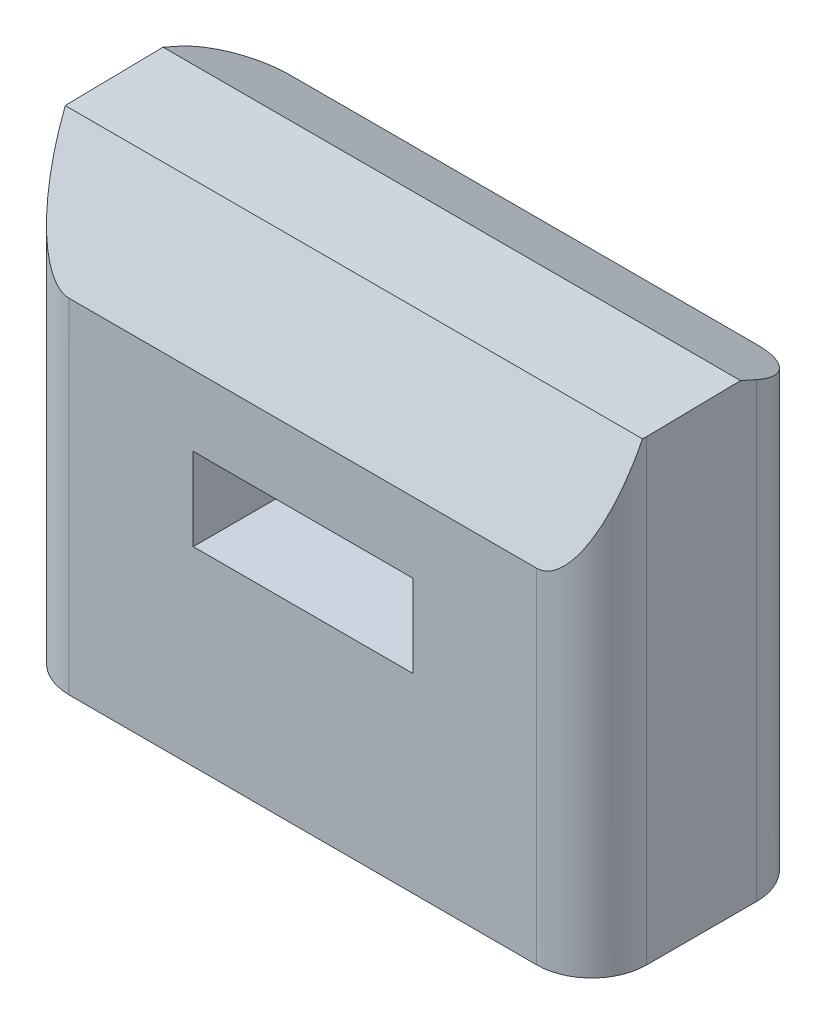
ISO-10303-21;
HEADER;
FILE_DESCRIPTION(('STEP AP214'),'2;1');
FILE_NAME('part.step','',(''),(''),'','','');
FILE_SCHEMA(('AUTOMOTIVE_DESIGN { 1 0 10303 214 1 1 1 1 }'));
ENDSEC;
DATA;
#1=APPLICATION_CONTEXT('core data for automotive mechanical design processes');
#2=APPLICATION_PROTOCOL_DEFINITION('international standard','automotive_design',2000,#1);
#3=PRODUCT_CONTEXT('',#1,'mechanical');
#4=PRODUCT('Part','Part','',(#3));
#5=PRODUCT_RELATED_PRODUCT_CATEGORY('part','',(#4));
#6=PRODUCT_DEFINITION_FORMATION('','',#4);
#7=PRODUCT_DEFINITION_CONTEXT('part definition',#1,'design');
#8=PRODUCT_DEFINITION('design','',#6,#7);
#9=PRODUCT_DEFINITION_SHAPE('','',#8);
#10=(LENGTH_UNIT() NAMED_UNIT(*) SI_UNIT(.MILLI.,.METRE.));
#11=(NAMED_UNIT(*) PLANE_ANGLE_UNIT() SI_UNIT($,.RADIAN.));
#12=(NAMED_UNIT(*) SI_UNIT($,.STERADIAN.) SOLID_ANGLE_UNIT());
#13=UNCERTAINTY_MEASURE_WITH_UNIT(LENGTH_MEASURE(1.E-05),#10,'distance_accuracy_value','');
#14=(GEOMETRIC_REPRESENTATION_CONTEXT(3) GLOBAL_UNCERTAINTY_ASSIGNED_CONTEXT((#13)) GLOBAL_UNIT_ASSIGNED_CONTEXT((#10,
#11,#12)) REPRESENTATION_CONTEXT('',''));
#15=CARTESIAN_POINT('',(0.,0.,0.));
#16=DIRECTION('',(0.,0.,1.));
#17=DIRECTION('',(1.,0.,0.));
#18=AXIS2_PLACEMENT_3D('',#15,#16,#17);
#19=CARTESIAN_POINT('',(-45.4997652654269,-58.8573743922204,40.));
#20=DIRECTION('',(0.,1.,0.));
#21=DIRECTION('',(0.,0.,1.));
#22=AXIS2_PLACEMENT_3D('',#19,#20,#21);
#23=PLANE('',#22);
#24=DIRECTION('',(0.,0.,-1.));
#25=VECTOR('',#24,1.);
#26=CARTESIAN_POINT('',(-45.4997652654269,-58.8573743922204,40.));
#27=LINE('',#26,#25);
#28=CARTESIAN_POINT('',(-45.4997652654269,-58.8573743922204,29.999999934));
#29=VERTEX_POINT('',#28);
#30=CARTESIAN_POINT('',(-45.4997652654269,-58.8573743922204,10.000000066));
#31=VERTEX_POINT('',#30);
#32=EDGE_CURVE('E286',#29,#31,#27,.T.);
#33=ORIENTED_EDGE('',*,*,#32,.T.);
#34=CARTESIAN_POINT('',(-35.4997651994269,-58.8573743922204,10.000000066));
#35=DIRECTION('',(0.,1.,0.));
#36=DIRECTION('',(0.,0.,1.));
#37=AXIS2_PLACEMENT_3D('',#34,#35,#36);
#38=CIRCLE('',#37,10.000000066);
#39=CARTESIAN_POINT('',(-35.4997651994269,-58.8573743922204,0.));
#40=VERTEX_POINT('',#39);
#41=EDGE_CURVE('E317',#31,#40,#38,.F.);
#42=ORIENTED_EDGE('',*,*,#41,.T.);
#43=DIRECTION('',(1.,0.,0.));
#44=VECTOR('',#43,1.);
#45=CARTESIAN_POINT('',(-45.4997652654269,-58.8573743922204,0.));
#46=LINE('',#45,#44);
#47=CARTESIAN_POINT('',(49.5002346685731,-58.8573743922204,0.));
#48=VERTEX_POINT('',#47);
#49=EDGE_CURVE('E280',#40,#48,#46,.T.);
#50=ORIENTED_EDGE('',*,*,#49,.T.);
#51=CARTESIAN_POINT('',(49.5002346685731,-58.8573743922204,10.000000066));
#52=DIRECTION('',(0.,1.,0.));
#53=DIRECTION('',(0.,0.,1.));
#54=AXIS2_PLACEMENT_3D('',#51,#52,#53);
#55=CIRCLE('',#54,10.000000066);
#56=CARTESIAN_POINT('',(59.5002347345731,-58.8573743922204,10.000000066));
#57=VERTEX_POINT('',#56);
#58=EDGE_CURVE('E310',#48,#57,#55,.F.);
#59=ORIENTED_EDGE('',*,*,#58,.T.);
#60=DIRECTION('',(0.,0.,-1.));
#61=VECTOR('',#60,1.);
#62=CARTESIAN_POINT('',(59.5002347345731,-58.8573743922204,40.));
#63=LINE('',#62,#61);
#64=CARTESIAN_POINT('',(59.5002347345731,-58.8573743922204,29.999999934));
#65=VERTEX_POINT('',#64);
#66=EDGE_CURVE('E291',#65,#57,#63,.T.);
#67=ORIENTED_EDGE('',*,*,#66,.F.);
#68=CARTESIAN_POINT('',(49.5002346685731,-58.8573743922204,29.999999934));
#69=DIRECTION('',(0.,1.,0.));
#70=DIRECTION('',(0.,0.,1.));
#71=AXIS2_PLACEMENT_3D('',#68,#69,#70);
#72=CIRCLE('',#71,10.000000066);
#73=CARTESIAN_POINT('',(49.5002346685731,-58.8573743922204,40.));
#74=VERTEX_POINT('',#73);
#75=EDGE_CURVE('E296',#65,#74,#72,.F.);
#76=ORIENTED_EDGE('',*,*,#75,.T.);
#77=DIRECTION('',(1.,0.,0.));
#78=VECTOR('',#77,1.);
#79=CARTESIAN_POINT('',(-45.4997652654269,-58.8573743922204,40.));
#80=LINE('',#79,#78);
#81=CARTESIAN_POINT('',(-35.4997651994269,-58.8573743922204,40.));
#82=VERTEX_POINT('',#81);
#83=EDGE_CURVE('E284',#82,#74,#80,.T.);
#84=ORIENTED_EDGE('',*,*,#83,.F.);
#85=CARTESIAN_POINT('',(-35.4997651994269,-58.8573743922204,29.999999934));
#86=DIRECTION('',(0.,1.,0.));
#87=DIRECTION('',(0.,0.,1.));
#88=AXIS2_PLACEMENT_3D('',#85,#86,#87);
#89=CIRCLE('',#88,10.000000066);
#90=EDGE_CURVE('E304',#82,#29,#89,.F.);
#91=ORIENTED_EDGE('',*,*,#90,.T.);
#92=EDGE_LOOP('',(#33,#42,#50,#59,#67,#76,#84,#91));
#93=FACE_BOUND('',#92,.T.);
#94=ADVANCED_FACE('F41',(#93),#23,.F.);
#95=CARTESIAN_POINT('',(59.5002347345731,31.1426256077796,40.));
#96=DIRECTION('',(1.,0.,0.));
#97=DIRECTION('',(0.,1.,0.));
#98=AXIS2_PLACEMENT_3D('',#95,#96,#97);
#99=PLANE('',#98);
#100=DIRECTION('',(0.,-0.407798932237558,-0.913071755595313));
#101=VECTOR('',#100,1.);
#102=CARTESIAN_POINT('',(59.5002347345731,35.7821027076506,37.9279023845892));
#103=LINE('',#102,#101);
#104=CARTESIAN_POINT('',(59.5002347345731,23.3088565740759,10.000000066));
#105=VERTEX_POINT('',#104);
#106=CARTESIAN_POINT('',(59.5002347345731,24.6211643907402,12.9382892750191));
#107=VERTEX_POINT('',#106);
#108=EDGE_CURVE('E327',#105,#107,#103,.F.);
#109=ORIENTED_EDGE('',*,*,#108,.T.);
#110=DIRECTION('',(0.,0.0162894503620875,-0.999867318101208));
#111=VECTOR('',#110,1.);
#112=CARTESIAN_POINT('',(59.5002347345731,24.1821329309667,39.8866023542304));
#113=LINE('',#112,#111);
#114=CARTESIAN_POINT('',(59.5002347345731,24.3432016212404,29.999999934));
#115=VERTEX_POINT('',#114);
#116=EDGE_CURVE('E342',#107,#115,#113,.F.);
#117=ORIENTED_EDGE('',*,*,#116,.T.);
#118=DIRECTION('',(0.,-1.,0.));
#119=VECTOR('',#118,1.);
#120=CARTESIAN_POINT('',(59.5002347345731,-58.8573743922204,29.999999934));
#121=LINE('',#120,#119);
#122=EDGE_CURVE('E294',#115,#65,#121,.T.);
#123=ORIENTED_EDGE('',*,*,#122,.T.);
#124=ORIENTED_EDGE('',*,*,#66,.T.);
#125=DIRECTION('',(0.,-1.,0.));
#126=VECTOR('',#125,1.);
#127=CARTESIAN_POINT('',(59.5002347345731,31.1426256077796,10.000000066));
#128=LINE('',#127,#126);
#129=EDGE_CURVE('E312',#57,#105,#128,.F.);
#130=ORIENTED_EDGE('',*,*,#129,.T.);
#131=EDGE_LOOP('',(#109,#117,#123,#124,#130));
#132=FACE_BOUND('',#131,.T.);
#133=ADVANCED_FACE('F803',(#132),#99,.T.);
#134=CARTESIAN_POINT('',(-45.4997652654269,31.1426256077796,40.));
#135=DIRECTION('',(1.,0.,0.));
#136=DIRECTION('',(0.,1.,0.));
#137=AXIS2_PLACEMENT_3D('',#134,#135,#136);
#138=PLANE('',#137);
#139=DIRECTION('',(0.,-1.,0.));
#140=VECTOR('',#139,1.);
#141=CARTESIAN_POINT('',(-45.4997652654269,31.1426256077796,29.999999934));
#142=LINE('',#141,#140);
#143=CARTESIAN_POINT('',(-45.4997652654269,24.3432016212404,29.999999934));
#144=VERTEX_POINT('',#143);
#145=EDGE_CURVE('E306',#29,#144,#142,.F.);
#146=ORIENTED_EDGE('',*,*,#145,.T.);
#147=DIRECTION('',(0.,-0.0162894503620875,0.999867318101208));
#148=VECTOR('',#147,1.);
#149=CARTESIAN_POINT('',(-45.4997652654269,31.1426256077796,-387.357349450669));
#150=LINE('',#149,#148);
#151=CARTESIAN_POINT('',(-45.4997652654269,24.6211643907402,12.9382892750192));
#152=VERTEX_POINT('',#151);
#153=EDGE_CURVE('E350',#144,#152,#150,.F.);
#154=ORIENTED_EDGE('',*,*,#153,.T.);
#155=DIRECTION('',(0.,0.407798932237558,0.913071755595313));
#156=VECTOR('',#155,1.);
#157=CARTESIAN_POINT('',(-45.4997652654269,18.8426256077796,0.));
#158=LINE('',#157,#156);
#159=CARTESIAN_POINT('',(-45.4997652654269,23.3088565740759,10.000000066));
#160=VERTEX_POINT('',#159);
#161=EDGE_CURVE('E330',#152,#160,#158,.F.);
#162=ORIENTED_EDGE('',*,*,#161,.T.);
#163=DIRECTION('',(0.,-1.,0.));
#164=VECTOR('',#163,1.);
#165=CARTESIAN_POINT('',(-45.4997652654269,-58.8573743922204,10.000000066));
#166=LINE('',#165,#164);
#167=EDGE_CURVE('E315',#160,#31,#166,.T.);
#168=ORIENTED_EDGE('',*,*,#167,.T.);
#169=ORIENTED_EDGE('',*,*,#32,.F.);
#170=EDGE_LOOP('',(#146,#154,#162,#168,#169));
#171=FACE_BOUND('',#170,.T.);
#172=ADVANCED_FACE('F795',(#171),#138,.F.);
#173=CARTESIAN_POINT('',(0.,0.,40.));
#174=DIRECTION('',(0.,0.,-1.));
#175=DIRECTION('',(-1.,0.,0.));
#176=AXIS2_PLACEMENT_3D('',#173,#174,#175);
#177=PLANE('',#176);
#178=DIRECTION('',(-1.,0.,0.));
#179=VECTOR('',#178,1.);
#180=CARTESIAN_POINT('',(-12.9547651994269,-9.2173743922204,40.));
#181=LINE('',#180,#179);
#182=CARTESIAN_POINT('',(27.0452348005731,-9.2173743922204,40.));
#183=VERTEX_POINT('',#182);
#184=CARTESIAN_POINT('',(-12.9547651994269,-9.2173743922204,40.));
#185=VERTEX_POINT('',#184);
#186=EDGE_CURVE('E274',#183,#185,#181,.T.);
#187=ORIENTED_EDGE('',*,*,#186,.F.);
#188=DIRECTION('',(0.,1.,0.));
#189=VECTOR('',#188,1.);
#190=CARTESIAN_POINT('',(27.0452348005731,-9.2173743922204,40.));
#191=LINE('',#190,#189);
#192=CARTESIAN_POINT('',(27.0452348005731,-24.2173743922204,40.));
#193=VERTEX_POINT('',#192);
#194=EDGE_CURVE('E158',#193,#183,#191,.T.);
#195=ORIENTED_EDGE('',*,*,#194,.F.);
#196=DIRECTION('',(1.,0.,0.));
#197=VECTOR('',#196,1.);
#198=CARTESIAN_POINT('',(-12.9547651994269,-24.2173743922204,40.));
#199=LINE('',#198,#197);
#200=CARTESIAN_POINT('',(-12.9547651994269,-24.2173743922204,40.));
#201=VERTEX_POINT('',#200);
#202=EDGE_CURVE('E265',#201,#193,#199,.T.);
#203=ORIENTED_EDGE('',*,*,#202,.F.);
#204=DIRECTION('',(0.,-1.,0.));
#205=VECTOR('',#204,1.);
#206=CARTESIAN_POINT('',(-12.9547651994269,-9.2173743922204,40.));
#207=LINE('',#206,#205);
#208=EDGE_CURVE('E268',#185,#201,#207,.T.);
#209=ORIENTED_EDGE('',*,*,#208,.F.);
#210=EDGE_LOOP('',(#187,#195,#203,#209));
#211=FACE_BOUND('',#210,.T.);
#212=DIRECTION('',(0.,-1.,0.));
#213=VECTOR('',#212,1.);
#214=CARTESIAN_POINT('',(49.5002346685731,31.1426256077796,40.));
#215=LINE('',#214,#213);
#216=CARTESIAN_POINT('',(49.5002346685731,3.6026256077796,40.));
#217=VERTEX_POINT('',#216);
#218=EDGE_CURVE('E299',#74,#217,#215,.F.);
#219=ORIENTED_EDGE('',*,*,#218,.T.);
#220=DIRECTION('',(-1.,0.,0.));
#221=VECTOR('',#220,1.);
#222=CARTESIAN_POINT('',(-35.4997651994269,3.6026256077796,40.));
#223=LINE('',#222,#221);
#224=CARTESIAN_POINT('',(-35.4997651994269,3.6026256077796,40.));
#225=VERTEX_POINT('',#224);
#226=EDGE_CURVE('E336',#217,#225,#223,.T.);
#227=ORIENTED_EDGE('',*,*,#226,.T.);
#228=DIRECTION('',(0.,-1.,0.));
#229=VECTOR('',#228,1.);
#230=CARTESIAN_POINT('',(-35.4997651994269,0.,40.));
#231=LINE('',#230,#229);
#232=EDGE_CURVE('E302',#225,#82,#231,.T.);
#233=ORIENTED_EDGE('',*,*,#232,.T.);
#234=ORIENTED_EDGE('',*,*,#83,.T.);
#235=EDGE_LOOP('',(#219,#227,#233,#234));
#236=FACE_BOUND('',#235,.T.);
#237=ADVANCED_FACE('F786',(#211,#236),#177,.F.);
#238=CARTESIAN_POINT('',(0.,0.,0.));
#239=DIRECTION('',(0.,0.,-1.));
#240=DIRECTION('',(-1.,0.,0.));
#241=AXIS2_PLACEMENT_3D('',#238,#239,#240);
#242=PLANE('',#241);
#243=DIRECTION('',(0.,-1.,0.));
#244=VECTOR('',#243,1.);
#245=CARTESIAN_POINT('',(-35.4997651994269,31.1426256077796,0.));
#246=LINE('',#245,#244);
#247=CARTESIAN_POINT('',(-35.4997651994269,18.8426256077796,0.));
#248=VERTEX_POINT('',#247);
#249=EDGE_CURVE('E319',#40,#248,#246,.F.);
#250=ORIENTED_EDGE('',*,*,#249,.T.);
#251=DIRECTION('',(1.,0.,0.));
#252=VECTOR('',#251,1.);
#253=CARTESIAN_POINT('',(0.,18.8426256077796,0.));
#254=LINE('',#253,#252);
#255=CARTESIAN_POINT('',(49.5002346685731,18.8426256077796,0.));
#256=VERTEX_POINT('',#255);
#257=EDGE_CURVE('E322',#248,#256,#254,.T.);
#258=ORIENTED_EDGE('',*,*,#257,.T.);
#259=DIRECTION('',(0.,-1.,0.));
#260=VECTOR('',#259,1.);
#261=CARTESIAN_POINT('',(49.5002346685731,0.,0.));
#262=LINE('',#261,#260);
#263=EDGE_CURVE('E308',#256,#48,#262,.T.);
#264=ORIENTED_EDGE('',*,*,#263,.T.);
#265=ORIENTED_EDGE('',*,*,#49,.F.);
#266=EDGE_LOOP('',(#250,#258,#264,#265));
#267=FACE_BOUND('',#266,.T.);
#268=ADVANCED_FACE('F777',(#267),#242,.T.);
#269=CARTESIAN_POINT('',(49.5002346685731,31.1426256077796,29.999999934));
#270=DIRECTION('',(0.,1.,0.));
#271=DIRECTION('',(-1.,0.,0.));
#272=AXIS2_PLACEMENT_3D('',#269,#270,#271);
#273=CYLINDRICAL_SURFACE('',#272,10.000000066);
#274=ORIENTED_EDGE('',*,*,#122,.F.);
#275=CARTESIAN_POINT('',(49.5002346685731,24.3432016212404,29.999999934));
#276=DIRECTION('',(0.,-0.999867318101208,-0.0162894503620875));
#277=DIRECTION('',(0.,0.0162894503620875,-0.999867318101208));
#278=AXIS2_PLACEMENT_3D('',#275,#276,#277);
#279=ELLIPSE('',#278,10.0013270610649,10.000000066);
#280=CARTESIAN_POINT('',(59.4726551379693,24.3311103110357,30.7421800344935));
#281=VERTEX_POINT('',#280);
#282=EDGE_CURVE('E344',#115,#281,#279,.T.);
#283=ORIENTED_EDGE('',*,*,#282,.T.);
#284=CARTESIAN_POINT('',(49.5002346685731,25.9928696579942,29.999999934));
#285=DIRECTION('',(0.,0.407798932237558,0.913071755595313));
#286=DIRECTION('',(0.,0.913071755595313,-0.407798932237558));
#287=AXIS2_PLACEMENT_3D('',#284,#285,#286);
#288=ELLIPSE('',#287,24.5218887924273,10.000000066);
#289=EDGE_CURVE('E334',#281,#217,#288,.F.);
#290=ORIENTED_EDGE('',*,*,#289,.T.);
#291=ORIENTED_EDGE('',*,*,#218,.F.);
#292=ORIENTED_EDGE('',*,*,#75,.F.);
#293=EDGE_LOOP('',(#274,#283,#290,#291,#292));
#294=FACE_BOUND('',#293,.T.);
#295=ADVANCED_FACE('F769',(#294),#273,.T.);
#296=CARTESIAN_POINT('',(-35.4997651994269,0.,29.999999934));
#297=DIRECTION('',(0.,-1.,0.));
#298=DIRECTION('',(1.,0.,0.));
#299=AXIS2_PLACEMENT_3D('',#296,#297,#298);
#300=CYLINDRICAL_SURFACE('',#299,10.000000066);
#301=CARTESIAN_POINT('',(-35.4997651994269,25.9928696579942,29.999999934));
#302=DIRECTION('',(0.,0.407798932237558,0.913071755595313));
#303=DIRECTION('',(0.,-0.913071755595313,0.407798932237558));
#304=AXIS2_PLACEMENT_3D('',#301,#302,#303);
#305=ELLIPSE('',#304,24.5218887924273,10.000000066);
#306=CARTESIAN_POINT('',(-45.4721856688231,24.3311103110357,30.7421800344935));
#307=VERTEX_POINT('',#306);
#308=EDGE_CURVE('E338',#225,#307,#305,.F.);
#309=ORIENTED_EDGE('',*,*,#308,.T.);
#310=CARTESIAN_POINT('',(-35.4997651994269,24.3432016212404,29.999999934));
#311=DIRECTION('',(0.,-0.999867318101208,-0.0162894503620875));
#312=DIRECTION('',(0.,-0.0162894503620875,0.999867318101208));
#313=AXIS2_PLACEMENT_3D('',#310,#311,#312);
#314=ELLIPSE('',#313,10.0013270610649,10.000000066);
#315=EDGE_CURVE('E166',#307,#144,#314,.T.);
#316=ORIENTED_EDGE('',*,*,#315,.T.);
#317=ORIENTED_EDGE('',*,*,#145,.F.);
#318=ORIENTED_EDGE('',*,*,#90,.F.);
#319=ORIENTED_EDGE('',*,*,#232,.F.);
#320=EDGE_LOOP('',(#309,#316,#317,#318,#319));
#321=FACE_BOUND('',#320,.T.);
#322=ADVANCED_FACE('F760',(#321),#300,.T.);
#323=CARTESIAN_POINT('',(49.5002346685731,0.,10.000000066));
#324=DIRECTION('',(0.,-1.,0.));
#325=DIRECTION('',(1.,0.,0.));
#326=AXIS2_PLACEMENT_3D('',#323,#324,#325);
#327=CYLINDRICAL_SURFACE('',#326,10.000000066);
#328=ORIENTED_EDGE('',*,*,#263,.F.);
#329=CARTESIAN_POINT('',(49.5002346685731,23.3088565740759,10.000000066));
#330=DIRECTION('',(0.,-0.913071755595313,0.407798932237558));
#331=DIRECTION('',(0.,-0.407798932237558,-0.913071755595313));
#332=AXIS2_PLACEMENT_3D('',#329,#330,#331);
#333=ELLIPSE('',#332,10.9520418353978,10.000000066);
#334=EDGE_CURVE('E325',#256,#105,#333,.T.);
#335=ORIENTED_EDGE('',*,*,#334,.T.);
#336=ORIENTED_EDGE('',*,*,#129,.F.);
#337=ORIENTED_EDGE('',*,*,#58,.F.);
#338=EDGE_LOOP('',(#328,#335,#336,#337));
#339=FACE_BOUND('',#338,.T.);
#340=ADVANCED_FACE('F750',(#339),#327,.T.);
#341=CARTESIAN_POINT('',(-35.4997651994269,31.1426256077796,10.000000066));
#342=DIRECTION('',(0.,1.,0.));
#343=DIRECTION('',(-1.,0.,0.));
#344=AXIS2_PLACEMENT_3D('',#341,#342,#343);
#345=CYLINDRICAL_SURFACE('',#344,10.000000066);
#346=ORIENTED_EDGE('',*,*,#167,.F.);
#347=CARTESIAN_POINT('',(-35.4997651994269,23.3088565740759,10.000000066));
#348=DIRECTION('',(0.,-0.913071755595313,0.407798932237558));
#349=DIRECTION('',(0.,0.407798932237558,0.913071755595313));
#350=AXIS2_PLACEMENT_3D('',#347,#348,#349);
#351=ELLIPSE('',#350,10.9520418353978,10.000000066);
#352=EDGE_CURVE('E332',#160,#248,#351,.T.);
#353=ORIENTED_EDGE('',*,*,#352,.T.);
#354=ORIENTED_EDGE('',*,*,#249,.F.);
#355=ORIENTED_EDGE('',*,*,#41,.F.);
#356=EDGE_LOOP('',(#346,#353,#354,#355));
#357=FACE_BOUND('',#356,.T.);
#358=ADVANCED_FACE('F740',(#357),#345,.T.);
#359=CARTESIAN_POINT('',(0.,18.8426256077796,0.));
#360=DIRECTION('',(0.,-0.913071755595313,0.407798932237558));
#361=DIRECTION('',(1.,0.,0.));
#362=AXIS2_PLACEMENT_3D('',#359,#360,#361);
#363=PLANE('',#362);
#364=ORIENTED_EDGE('',*,*,#161,.F.);
#365=DIRECTION('',(1.,0.,0.));
#366=VECTOR('',#365,1.);
#367=CARTESIAN_POINT('',(0.,24.6211643907402,12.9382892750191));
#368=LINE('',#367,#366);
#369=EDGE_CURVE('E340',#152,#107,#368,.T.);
#370=ORIENTED_EDGE('',*,*,#369,.T.);
#371=ORIENTED_EDGE('',*,*,#108,.F.);
#372=ORIENTED_EDGE('',*,*,#334,.F.);
#373=ORIENTED_EDGE('',*,*,#257,.F.);
#374=ORIENTED_EDGE('',*,*,#352,.F.);
#375=EDGE_LOOP('',(#364,#370,#371,#372,#373,#374));
#376=FACE_BOUND('',#375,.T.);
#377=ADVANCED_FACE('F732',(#376),#363,.F.);
#378=CARTESIAN_POINT('',(-45.4997652654269,31.1426256077796,27.7));
#379=DIRECTION('',(0.,0.407798932237558,0.913071755595313));
#380=DIRECTION('',(-1.,0.,0.));
#381=AXIS2_PLACEMENT_3D('',#378,#379,#380);
#382=PLANE('',#381);
#383=ORIENTED_EDGE('',*,*,#289,.F.);
#384=DIRECTION('',(-1.,0.,0.));
#385=VECTOR('',#384,1.);
#386=CARTESIAN_POINT('',(-45.4997652654269,24.3311103110357,30.7421800344935));
#387=LINE('',#386,#385);
#388=EDGE_CURVE('E346',#281,#307,#387,.T.);
#389=ORIENTED_EDGE('',*,*,#388,.T.);
#390=ORIENTED_EDGE('',*,*,#308,.F.);
#391=ORIENTED_EDGE('',*,*,#226,.F.);
#392=EDGE_LOOP('',(#383,#389,#390,#391));
#393=FACE_BOUND('',#392,.T.);
#394=ADVANCED_FACE('F724',(#393),#382,.T.);
#395=CARTESIAN_POINT('',(-45.4997652654269,31.1426256077796,-387.357349450669));
#396=DIRECTION('',(0.,-0.999867318101208,-0.0162894503620875));
#397=DIRECTION('',(1.,0.,0.));
#398=AXIS2_PLACEMENT_3D('',#395,#396,#397);
#399=PLANE('',#398);
#400=ORIENTED_EDGE('',*,*,#315,.F.);
#401=ORIENTED_EDGE('',*,*,#388,.F.);
#402=ORIENTED_EDGE('',*,*,#282,.F.);
#403=ORIENTED_EDGE('',*,*,#116,.F.);
#404=ORIENTED_EDGE('',*,*,#369,.F.);
#405=ORIENTED_EDGE('',*,*,#153,.F.);
#406=EDGE_LOOP('',(#400,#401,#402,#403,#404,#405));
#407=FACE_BOUND('',#406,.T.);
#408=ADVANCED_FACE('F508',(#407),#399,.F.);
#409=CARTESIAN_POINT('',(27.0452348005731,-9.2173743922204,22.22));
#410=DIRECTION('',(1.,0.,0.));
#411=DIRECTION('',(0.,1.,0.));
#412=AXIS2_PLACEMENT_3D('',#409,#410,#411);
#413=PLANE('',#412);
#414=ORIENTED_EDGE('',*,*,#194,.T.);
#415=DIRECTION('',(0.,0.,1.));
#416=VECTOR('',#415,1.);
#417=CARTESIAN_POINT('',(27.0452348005731,-9.2173743922204,22.22));
#418=LINE('',#417,#416);
#419=CARTESIAN_POINT('',(27.0452348005731,-9.2173743922204,22.22));
#420=VERTEX_POINT('',#419);
#421=EDGE_CURVE('E243',#420,#183,#418,.T.);
#422=ORIENTED_EDGE('',*,*,#421,.F.);
#423=DIRECTION('',(0.,1.,0.));
#424=VECTOR('',#423,1.);
#425=CARTESIAN_POINT('',(27.0452348005731,-9.2173743922204,22.22));
#426=LINE('',#425,#424);
#427=CARTESIAN_POINT('',(27.0452348005731,-24.2173743922204,22.22));
#428=VERTEX_POINT('',#427);
#429=EDGE_CURVE('E247',#428,#420,#426,.T.);
#430=ORIENTED_EDGE('',*,*,#429,.F.);
#431=DIRECTION('',(0.,0.,1.));
#432=VECTOR('',#431,1.);
#433=CARTESIAN_POINT('',(27.0452348005731,-24.2173743922204,22.22));
#434=LINE('',#433,#432);
#435=EDGE_CURVE('E278',#428,#193,#434,.T.);
#436=ORIENTED_EDGE('',*,*,#435,.T.);
#437=EDGE_LOOP('',(#414,#422,#430,#436));
#438=FACE_BOUND('',#437,.T.);
#439=ADVANCED_FACE('F245',(#438),#413,.F.);
#440=CARTESIAN_POINT('',(-12.9547651994269,-24.2173743922204,22.22));
#441=DIRECTION('',(0.,-1.,0.));
#442=DIRECTION('',(0.,0.,-1.));
#443=AXIS2_PLACEMENT_3D('',#440,#441,#442);
#444=PLANE('',#443);
#445=ORIENTED_EDGE('',*,*,#202,.T.);
#446=ORIENTED_EDGE('',*,*,#435,.F.);
#447=DIRECTION('',(1.,0.,0.));
#448=VECTOR('',#447,1.);
#449=CARTESIAN_POINT('',(-12.9547651994269,-24.2173743922204,22.22));
#450=LINE('',#449,#448);
#451=CARTESIAN_POINT('',(-12.9547651994269,-24.2173743922204,22.22));
#452=VERTEX_POINT('',#451);
#453=EDGE_CURVE('E253',#452,#428,#450,.T.);
#454=ORIENTED_EDGE('',*,*,#453,.F.);
#455=DIRECTION('',(0.,0.,1.));
#456=VECTOR('',#455,1.);
#457=CARTESIAN_POINT('',(-12.9547651994269,-24.2173743922204,22.22));
#458=LINE('',#457,#456);
#459=EDGE_CURVE('E281',#452,#201,#458,.T.);
#460=ORIENTED_EDGE('',*,*,#459,.T.);
#461=EDGE_LOOP('',(#445,#446,#454,#460));
#462=FACE_BOUND('',#461,.T.);
#463=ADVANCED_FACE('F615',(#462),#444,.F.);
#464=CARTESIAN_POINT('',(-12.9547651994269,-9.2173743922204,22.22));
#465=DIRECTION('',(-1.,0.,0.));
#466=DIRECTION('',(0.,-1.,0.));
#467=AXIS2_PLACEMENT_3D('',#464,#465,#466);
#468=PLANE('',#467);
#469=ORIENTED_EDGE('',*,*,#208,.T.);
#470=ORIENTED_EDGE('',*,*,#459,.F.);
#471=DIRECTION('',(0.,-1.,0.));
#472=VECTOR('',#471,1.);
#473=CARTESIAN_POINT('',(-12.9547651994269,-9.2173743922204,22.22));
#474=LINE('',#473,#472);
#475=CARTESIAN_POINT('',(-12.9547651994269,-9.2173743922204,22.22));
#476=VERTEX_POINT('',#475);
#477=EDGE_CURVE('E261',#476,#452,#474,.T.);
#478=ORIENTED_EDGE('',*,*,#477,.F.);
#479=DIRECTION('',(0.,0.,1.));
#480=VECTOR('',#479,1.);
#481=CARTESIAN_POINT('',(-12.9547651994269,-9.2173743922204,22.22));
#482=LINE('',#481,#480);
#483=EDGE_CURVE('E252',#476,#185,#482,.T.);
#484=ORIENTED_EDGE('',*,*,#483,.T.);
#485=EDGE_LOOP('',(#469,#470,#478,#484));
#486=FACE_BOUND('',#485,.T.);
#487=ADVANCED_FACE('F610',(#486),#468,.F.);
#488=CARTESIAN_POINT('',(-12.9547651994269,-9.2173743922204,22.22));
#489=DIRECTION('',(0.,1.,0.));
#490=DIRECTION('',(0.,0.,1.));
#491=AXIS2_PLACEMENT_3D('',#488,#489,#490);
#492=PLANE('',#491);
#493=ORIENTED_EDGE('',*,*,#186,.T.);
#494=ORIENTED_EDGE('',*,*,#483,.F.);
#495=DIRECTION('',(-1.,0.,0.));
#496=VECTOR('',#495,1.);
#497=CARTESIAN_POINT('',(-12.9547651994269,-9.2173743922204,22.22));
#498=LINE('',#497,#496);
#499=EDGE_CURVE('E256',#420,#476,#498,.T.);
#500=ORIENTED_EDGE('',*,*,#499,.F.);
#501=ORIENTED_EDGE('',*,*,#421,.T.);
#502=EDGE_LOOP('',(#493,#494,#500,#501));
#503=FACE_BOUND('',#502,.T.);
#504=ADVANCED_FACE('F257',(#503),#492,.F.);
#505=CARTESIAN_POINT('',(0.,0.,22.22));
#506=DIRECTION('',(0.,0.,1.));
#507=DIRECTION('',(1.,0.,0.));
#508=AXIS2_PLACEMENT_3D('',#505,#506,#507);
#509=PLANE('',#508);
#510=ORIENTED_EDGE('',*,*,#429,.T.);
#511=ORIENTED_EDGE('',*,*,#499,.T.);
#512=ORIENTED_EDGE('',*,*,#477,.T.);
#513=ORIENTED_EDGE('',*,*,#453,.T.);
#514=EDGE_LOOP('',(#510,#511,#512,#513));
#515=FACE_BOUND('',#514,.T.);
#516=ADVANCED_FACE('F263',(#515),#509,.T.);
#517=CLOSED_SHELL('',(#94,#133,#172,#237,#268,#295,#322,#340,#358,#377,#394,#408,#439,#463,#487,
#504,#516));
#518=CARTESIAN_POINT('',(-45.4997652654269,-56.3173743922204,40.));
#519=DIRECTION('',(0.,1.,0.));
#520=DIRECTION('',(0.,0.,1.));
#521=AXIS2_PLACEMENT_3D('',#518,#519,#520);
#522=PLANE('',#521);
#523=DIRECTION('',(0.,0.,-1.));
#524=VECTOR('',#523,1.);
#525=CARTESIAN_POINT('',(-42.9597652654269,-56.3173743922204,40.));
#526=LINE('',#525,#524);
#527=CARTESIAN_POINT('',(-42.9597652654269,-56.3173743922204,29.999999934));
#528=VERTEX_POINT('',#527);
#529=CARTESIAN_POINT('',(-42.9597652654269,-56.3173743922204,10.000000066));
#530=VERTEX_POINT('',#529);
#531=EDGE_CURVE('E45',#528,#530,#526,.T.);
#532=ORIENTED_EDGE('',*,*,#531,.F.);
#533=CARTESIAN_POINT('',(-35.4997651994269,-56.3173743922204,29.999999934));
#534=DIRECTION('',(0.,1.,0.));
#535=DIRECTION('',(0.,0.,1.));
#536=AXIS2_PLACEMENT_3D('',#533,#534,#535);
#537=CIRCLE('',#536,7.460000066);
#538=CARTESIAN_POINT('',(-35.4997651994269,-56.3173743922204,37.46));
#539=VERTEX_POINT('',#538);
#540=EDGE_CURVE('E433',#539,#528,#537,.F.);
#541=ORIENTED_EDGE('',*,*,#540,.F.);
#542=DIRECTION('',(1.,0.,0.));
#543=VECTOR('',#542,1.);
#544=CARTESIAN_POINT('',(0.,-56.3173743922204,37.46));
#545=LINE('',#544,#543);
#546=CARTESIAN_POINT('',(49.5002346685731,-56.3173743922204,37.46));
#547=VERTEX_POINT('',#546);
#548=EDGE_CURVE('E401',#539,#547,#545,.T.);
#549=ORIENTED_EDGE('',*,*,#548,.T.);
#550=CARTESIAN_POINT('',(49.5002346685731,-56.3173743922204,29.999999934));
#551=DIRECTION('',(0.,1.,0.));
#552=DIRECTION('',(0.,0.,1.));
#553=AXIS2_PLACEMENT_3D('',#550,#551,#552);
#554=CIRCLE('',#553,7.460000066);
#555=CARTESIAN_POINT('',(56.9602347345731,-56.3173743922204,29.999999934));
#556=VERTEX_POINT('',#555);
#557=EDGE_CURVE('E435',#556,#547,#554,.F.);
#558=ORIENTED_EDGE('',*,*,#557,.F.);
#559=DIRECTION('',(0.,0.,-1.));
#560=VECTOR('',#559,1.);
#561=CARTESIAN_POINT('',(56.9602347345731,-56.3173743922204,40.));
#562=LINE('',#561,#560);
#563=CARTESIAN_POINT('',(56.9602347345731,-56.3173743922204,10.000000066));
#564=VERTEX_POINT('',#563);
#565=EDGE_CURVE('E424',#556,#564,#562,.T.);
#566=ORIENTED_EDGE('',*,*,#565,.T.);
#567=CARTESIAN_POINT('',(49.5002346685731,-56.3173743922204,10.000000066));
#568=DIRECTION('',(0.,1.,0.));
#569=DIRECTION('',(0.,0.,1.));
#570=AXIS2_PLACEMENT_3D('',#567,#568,#569);
#571=CIRCLE('',#570,7.460000066);
#572=CARTESIAN_POINT('',(49.5002346685731,-56.3173743922204,2.54));
#573=VERTEX_POINT('',#572);
#574=EDGE_CURVE('E144',#573,#564,#571,.F.);
#575=ORIENTED_EDGE('',*,*,#574,.F.);
#576=DIRECTION('',(1.,0.,0.));
#577=VECTOR('',#576,1.);
#578=CARTESIAN_POINT('',(0.,-56.3173743922204,2.54));
#579=LINE('',#578,#577);
#580=CARTESIAN_POINT('',(-35.4997651994269,-56.3173743922204,2.54));
#581=VERTEX_POINT('',#580);
#582=EDGE_CURVE('E439',#581,#573,#579,.T.);
#583=ORIENTED_EDGE('',*,*,#582,.F.);
#584=CARTESIAN_POINT('',(-35.4997651994269,-56.3173743922204,10.000000066));
#585=DIRECTION('',(0.,1.,0.));
#586=DIRECTION('',(0.,0.,1.));
#587=AXIS2_PLACEMENT_3D('',#584,#585,#586);
#588=CIRCLE('',#587,7.460000066);
#589=EDGE_CURVE('E150',#530,#581,#588,.F.);
#590=ORIENTED_EDGE('',*,*,#589,.F.);
#591=EDGE_LOOP('',(#532,#541,#549,#558,#566,#575,#583,#590));
#592=FACE_BOUND('',#591,.T.);
#593=ADVANCED_FACE('F451',(#592),#522,.T.);
#594=CARTESIAN_POINT('',(56.9602347345731,31.1426256077796,40.));
#595=DIRECTION('',(1.,0.,0.));
#596=DIRECTION('',(0.,1.,0.));
#597=AXIS2_PLACEMENT_3D('',#594,#595,#596);
#598=PLANE('',#597);
#599=DIRECTION('',(0.,-0.407798932237558,-0.913071755595313));
#600=VECTOR('',#599,1.);
#601=CARTESIAN_POINT('',(56.9602347345731,33.4629004484385,38.9637116724726));
#602=LINE('',#601,#600);
#603=CARTESIAN_POINT('',(56.9602347345731,20.5270379662449,10.000000066));
#604=VERTEX_POINT('',#603);
#605=CARTESIAN_POINT('',(56.9602347345731,22.0723287408884,13.4599438004458));
#606=VERTEX_POINT('',#605);
#607=EDGE_CURVE('E430',#604,#606,#602,.F.);
#608=ORIENTED_EDGE('',*,*,#607,.F.);
#609=DIRECTION('',(0.,1.,0.));
#610=VECTOR('',#609,1.);
#611=CARTESIAN_POINT('',(56.9602347345731,31.1426256077796,10.000000066));
#612=LINE('',#611,#610);
#613=EDGE_CURVE('E422',#564,#604,#612,.T.);
#614=ORIENTED_EDGE('',*,*,#613,.F.);
#615=ORIENTED_EDGE('',*,*,#565,.F.);
#616=DIRECTION('',(0.,1.,0.));
#617=VECTOR('',#616,1.);
#618=CARTESIAN_POINT('',(56.9602347345731,31.1426256077796,29.999999934));
#619=LINE('',#618,#617);
#620=CARTESIAN_POINT('',(56.9602347345731,19.7643099458262,29.999999934));
#621=VERTEX_POINT('',#620);
#622=EDGE_CURVE('E426',#621,#556,#619,.F.);
#623=ORIENTED_EDGE('',*,*,#622,.F.);
#624=DIRECTION('',(0.,0.913071755595313,-0.407798932237558));
#625=VECTOR('',#624,1.);
#626=CARTESIAN_POINT('',(56.9602347345731,30.1068163198962,25.3807977407879));
#627=LINE('',#626,#625);
#628=CARTESIAN_POINT('',(56.9602347345731,21.8178062350107,29.0828610684601));
#629=VERTEX_POINT('',#628);
#630=EDGE_CURVE('E380',#621,#629,#627,.T.);
#631=ORIENTED_EDGE('',*,*,#630,.T.);
#632=DIRECTION('',(0.,0.0162894503620875,-0.999867318101208));
#633=VECTOR('',#632,1.);
#634=CARTESIAN_POINT('',(56.9602347345731,21.6424699429896,39.8452271503107));
#635=LINE('',#634,#633);
#636=EDGE_CURVE('E428',#606,#629,#635,.F.);
#637=ORIENTED_EDGE('',*,*,#636,.F.);
#638=EDGE_LOOP('',(#608,#614,#615,#623,#631,#637));
#639=FACE_BOUND('',#638,.T.);
#640=ADVANCED_FACE('F483',(#639),#598,.F.);
#641=CARTESIAN_POINT('',(-42.9597652654269,31.1426256077796,40.));
#642=DIRECTION('',(1.,0.,0.));
#643=DIRECTION('',(0.,1.,0.));
#644=AXIS2_PLACEMENT_3D('',#641,#642,#643);
#645=PLANE('',#644);
#646=DIRECTION('',(0.,1.,0.));
#647=VECTOR('',#646,1.);
#648=CARTESIAN_POINT('',(-42.9597652654269,31.1426256077796,29.999999934));
#649=LINE('',#648,#647);
#650=CARTESIAN_POINT('',(-42.9597652654269,19.7643099458262,29.999999934));
#651=VERTEX_POINT('',#650);
#652=EDGE_CURVE('E419',#528,#651,#649,.T.);
#653=ORIENTED_EDGE('',*,*,#652,.F.);
#654=ORIENTED_EDGE('',*,*,#531,.T.);
#655=DIRECTION('',(0.,1.,0.));
#656=VECTOR('',#655,1.);
#657=CARTESIAN_POINT('',(-42.9597652654269,31.1426256077796,10.000000066));
#658=LINE('',#657,#656);
#659=CARTESIAN_POINT('',(-42.9597652654269,20.5270379662449,10.000000066));
#660=VERTEX_POINT('',#659);
#661=EDGE_CURVE('E410',#660,#530,#658,.F.);
#662=ORIENTED_EDGE('',*,*,#661,.F.);
#663=DIRECTION('',(0.,0.407798932237558,0.913071755595313));
#664=VECTOR('',#663,1.);
#665=CARTESIAN_POINT('',(-42.9597652654269,16.5234233485675,1.03580928788339));
#666=LINE('',#665,#664);
#667=CARTESIAN_POINT('',(-42.9597652654269,22.0723287408884,13.4599438004458));
#668=VERTEX_POINT('',#667);
#669=EDGE_CURVE('E412',#668,#660,#666,.F.);
#670=ORIENTED_EDGE('',*,*,#669,.F.);
#671=DIRECTION('',(0.,-0.0162894503620875,0.999867318101208));
#672=VECTOR('',#671,1.);
#673=CARTESIAN_POINT('',(-42.9597652654269,28.6029626198025,-387.398724654589));
#674=LINE('',#673,#672);
#675=CARTESIAN_POINT('',(-42.9597652654269,21.8178062350107,29.0828610684601));
#676=VERTEX_POINT('',#675);
#677=EDGE_CURVE('E414',#676,#668,#674,.F.);
#678=ORIENTED_EDGE('',*,*,#677,.F.);
#679=DIRECTION('',(0.,0.913071755595313,-0.407798932237558));
#680=VECTOR('',#679,1.);
#681=CARTESIAN_POINT('',(-42.9597652654269,30.1068163198962,25.3807977407879));
#682=LINE('',#681,#680);
#683=EDGE_CURVE('E416',#651,#676,#682,.T.);
#684=ORIENTED_EDGE('',*,*,#683,.F.);
#685=EDGE_LOOP('',(#653,#654,#662,#670,#678,#684));
#686=FACE_BOUND('',#685,.T.);
#687=ADVANCED_FACE('F446',(#686),#645,.T.);
#688=CARTESIAN_POINT('',(0.,0.,37.46));
#689=DIRECTION('',(0.,0.,-1.));
#690=DIRECTION('',(-1.,0.,0.));
#691=AXIS2_PLACEMENT_3D('',#688,#689,#690);
#692=PLANE('',#691);
#693=DIRECTION('',(-1.,0.,0.));
#694=VECTOR('',#693,1.);
#695=CARTESIAN_POINT('',(-12.9547651994269,-6.67737439222041,37.46));
#696=LINE('',#695,#694);
#697=CARTESIAN_POINT('',(29.5852348005731,-6.67737439222041,37.46));
#698=VERTEX_POINT('',#697);
#699=CARTESIAN_POINT('',(-15.4947651994269,-6.67737439222041,37.46));
#700=VERTEX_POINT('',#699);
#701=EDGE_CURVE('E362',#698,#700,#696,.T.);
#702=ORIENTED_EDGE('',*,*,#701,.T.);
#703=DIRECTION('',(0.,-1.,0.));
#704=VECTOR('',#703,1.);
#705=CARTESIAN_POINT('',(-15.4947651994269,-9.2173743922204,37.46));
#706=LINE('',#705,#704);
#707=CARTESIAN_POINT('',(-15.4947651994269,-26.7573743922204,37.46));
#708=VERTEX_POINT('',#707);
#709=EDGE_CURVE('E366',#700,#708,#706,.T.);
#710=ORIENTED_EDGE('',*,*,#709,.T.);
#711=DIRECTION('',(1.,0.,0.));
#712=VECTOR('',#711,1.);
#713=CARTESIAN_POINT('',(-12.9547651994269,-26.7573743922204,37.46));
#714=LINE('',#713,#712);
#715=CARTESIAN_POINT('',(29.5852348005731,-26.7573743922204,37.46));
#716=VERTEX_POINT('',#715);
#717=EDGE_CURVE('E371',#708,#716,#714,.T.);
#718=ORIENTED_EDGE('',*,*,#717,.T.);
#719=DIRECTION('',(0.,1.,0.));
#720=VECTOR('',#719,1.);
#721=CARTESIAN_POINT('',(29.5852348005731,-9.2173743922204,37.46));
#722=LINE('',#721,#720);
#723=EDGE_CURVE('E376',#716,#698,#722,.T.);
#724=ORIENTED_EDGE('',*,*,#723,.T.);
#725=EDGE_LOOP('',(#702,#710,#718,#724));
#726=FACE_BOUND('',#725,.T.);
#727=DIRECTION('',(0.,1.,0.));
#728=VECTOR('',#727,1.);
#729=CARTESIAN_POINT('',(49.5002346685731,0.,37.46));
#730=LINE('',#729,#728);
#731=CARTESIAN_POINT('',(49.5002346685731,3.06118784683107,37.46));
#732=VERTEX_POINT('',#731);
#733=EDGE_CURVE('E407',#547,#732,#730,.T.);
#734=ORIENTED_EDGE('',*,*,#733,.F.);
#735=ORIENTED_EDGE('',*,*,#548,.F.);
#736=DIRECTION('',(0.,1.,0.));
#737=VECTOR('',#736,1.);
#738=CARTESIAN_POINT('',(-35.4997651994269,0.,37.46));
#739=LINE('',#738,#737);
#740=CARTESIAN_POINT('',(-35.4997651994269,3.06118784683107,37.46));
#741=VERTEX_POINT('',#740);
#742=EDGE_CURVE('E403',#741,#539,#739,.F.);
#743=ORIENTED_EDGE('',*,*,#742,.F.);
#744=DIRECTION('',(-1.,0.,0.));
#745=VECTOR('',#744,1.);
#746=CARTESIAN_POINT('',(-45.4997652654269,3.06118784683107,37.46));
#747=LINE('',#746,#745);
#748=EDGE_CURVE('E405',#732,#741,#747,.T.);
#749=ORIENTED_EDGE('',*,*,#748,.F.);
#750=EDGE_LOOP('',(#734,#735,#743,#749));
#751=FACE_BOUND('',#750,.T.);
#752=ADVANCED_FACE('F474',(#726,#751),#692,.T.);
#753=CARTESIAN_POINT('',(0.,0.,2.54));
#754=DIRECTION('',(0.,0.,-1.));
#755=DIRECTION('',(-1.,0.,0.));
#756=AXIS2_PLACEMENT_3D('',#753,#754,#755);
#757=PLANE('',#756);
#758=DIRECTION('',(0.,1.,0.));
#759=VECTOR('',#758,1.);
#760=CARTESIAN_POINT('',(-35.4997651994269,0.,2.54));
#761=LINE('',#760,#759);
#762=CARTESIAN_POINT('',(-35.4997651994269,17.1952296579006,2.54));
#763=VERTEX_POINT('',#762);
#764=EDGE_CURVE('E399',#581,#763,#761,.T.);
#765=ORIENTED_EDGE('',*,*,#764,.F.);
#766=ORIENTED_EDGE('',*,*,#582,.T.);
#767=DIRECTION('',(0.,1.,0.));
#768=VECTOR('',#767,1.);
#769=CARTESIAN_POINT('',(49.5002346685731,0.,2.54));
#770=LINE('',#769,#768);
#771=CARTESIAN_POINT('',(49.5002346685731,17.1952296579006,2.54));
#772=VERTEX_POINT('',#771);
#773=EDGE_CURVE('E394',#772,#573,#770,.F.);
#774=ORIENTED_EDGE('',*,*,#773,.F.);
#775=DIRECTION('',(-1.,0.,0.));
#776=VECTOR('',#775,1.);
#777=CARTESIAN_POINT('',(0.,17.1952296579006,2.54));
#778=LINE('',#777,#776);
#779=EDGE_CURVE('E396',#763,#772,#778,.F.);
#780=ORIENTED_EDGE('',*,*,#779,.F.);
#781=EDGE_LOOP('',(#765,#766,#774,#780));
#782=FACE_BOUND('',#781,.T.);
#783=ADVANCED_FACE('F457',(#782),#757,.F.);
#784=CARTESIAN_POINT('',(49.5002346685731,31.1426256077796,29.999999934));
#785=DIRECTION('',(0.,1.,0.));
#786=DIRECTION('',(-1.,0.,0.));
#787=AXIS2_PLACEMENT_3D('',#784,#785,#786);
#788=CYLINDRICAL_SURFACE('',#787,7.460000066);
#789=ORIENTED_EDGE('',*,*,#622,.T.);
#790=ORIENTED_EDGE('',*,*,#557,.T.);
#791=ORIENTED_EDGE('',*,*,#733,.T.);
#792=CARTESIAN_POINT('',(49.5002346685731,19.7643099458262,29.999999934));
#793=DIRECTION('',(0.,0.407798932237558,0.913071755595313));
#794=DIRECTION('',(0.,0.913071755595313,-0.407798932237558));
#795=AXIS2_PLACEMENT_3D('',#792,#793,#794);
#796=ELLIPSE('',#795,18.2933290802593,7.460000066);
#797=EDGE_CURVE('E392',#621,#732,#796,.F.);
#798=ORIENTED_EDGE('',*,*,#797,.F.);
#799=EDGE_LOOP('',(#789,#790,#791,#798));
#800=FACE_BOUND('',#799,.T.);
#801=ADVANCED_FACE('F478',(#800),#788,.F.);
#802=CARTESIAN_POINT('',(-35.4997651994269,0.,29.999999934));
#803=DIRECTION('',(0.,-1.,0.));
#804=DIRECTION('',(1.,0.,0.));
#805=AXIS2_PLACEMENT_3D('',#802,#803,#804);
#806=CYLINDRICAL_SURFACE('',#805,7.460000066);
#807=CARTESIAN_POINT('',(-35.4997651994269,19.7643099458262,29.999999934));
#808=DIRECTION('',(0.,0.407798932237558,0.913071755595313));
#809=DIRECTION('',(0.,-0.913071755595313,0.407798932237558));
#810=AXIS2_PLACEMENT_3D('',#807,#808,#809);
#811=ELLIPSE('',#810,18.2933290802593,7.460000066);
#812=EDGE_CURVE('E389',#741,#651,#811,.F.);
#813=ORIENTED_EDGE('',*,*,#812,.F.);
#814=ORIENTED_EDGE('',*,*,#742,.T.);
#815=ORIENTED_EDGE('',*,*,#540,.T.);
#816=ORIENTED_EDGE('',*,*,#652,.T.);
#817=EDGE_LOOP('',(#813,#814,#815,#816));
#818=FACE_BOUND('',#817,.T.);
#819=ADVANCED_FACE('F471',(#818),#806,.F.);
#820=CARTESIAN_POINT('',(49.5002346685731,0.,10.000000066));
#821=DIRECTION('',(0.,-1.,0.));
#822=DIRECTION('',(1.,0.,0.));
#823=AXIS2_PLACEMENT_3D('',#820,#821,#822);
#824=CYLINDRICAL_SURFACE('',#823,7.460000066);
#825=ORIENTED_EDGE('',*,*,#773,.T.);
#826=ORIENTED_EDGE('',*,*,#574,.T.);
#827=ORIENTED_EDGE('',*,*,#613,.T.);
#828=CARTESIAN_POINT('',(49.5002346685731,20.5270379662449,10.000000066));
#829=DIRECTION('',(0.,-0.913071755595313,0.407798932237558));
#830=DIRECTION('',(0.,-0.407798932237558,-0.913071755595313));
#831=AXIS2_PLACEMENT_3D('',#828,#829,#830);
#832=ELLIPSE('',#831,8.17022322756678,7.460000066);
#833=EDGE_CURVE('E387',#772,#604,#832,.T.);
#834=ORIENTED_EDGE('',*,*,#833,.F.);
#835=EDGE_LOOP('',(#825,#826,#827,#834));
#836=FACE_BOUND('',#835,.T.);
#837=ADVANCED_FACE('F486',(#836),#824,.F.);
#838=CARTESIAN_POINT('',(-35.4997651994269,31.1426256077796,10.000000066));
#839=DIRECTION('',(0.,1.,0.));
#840=DIRECTION('',(-1.,0.,0.));
#841=AXIS2_PLACEMENT_3D('',#838,#839,#840);
#842=CYLINDRICAL_SURFACE('',#841,7.460000066);
#843=ORIENTED_EDGE('',*,*,#661,.T.);
#844=ORIENTED_EDGE('',*,*,#589,.T.);
#845=ORIENTED_EDGE('',*,*,#764,.T.);
#846=CARTESIAN_POINT('',(-35.4997651994269,20.5270379662449,10.000000066));
#847=DIRECTION('',(0.,-0.913071755595313,0.407798932237558));
#848=DIRECTION('',(0.,0.407798932237558,0.913071755595313));
#849=AXIS2_PLACEMENT_3D('',#846,#847,#848);
#850=ELLIPSE('',#849,8.17022322756678,7.460000066);
#851=EDGE_CURVE('E385',#660,#763,#850,.T.);
#852=ORIENTED_EDGE('',*,*,#851,.F.);
#853=EDGE_LOOP('',(#843,#844,#845,#852));
#854=FACE_BOUND('',#853,.T.);
#855=ADVANCED_FACE('F458',(#854),#842,.F.);
#856=CARTESIAN_POINT('',(0.,16.5234233485675,1.0358092878834));
#857=DIRECTION('',(0.,-0.913071755595313,0.407798932237558));
#858=DIRECTION('',(1.,0.,0.));
#859=AXIS2_PLACEMENT_3D('',#856,#857,#858);
#860=PLANE('',#859);
#861=ORIENTED_EDGE('',*,*,#669,.T.);
#862=ORIENTED_EDGE('',*,*,#851,.T.);
#863=ORIENTED_EDGE('',*,*,#779,.T.);
#864=ORIENTED_EDGE('',*,*,#833,.T.);
#865=ORIENTED_EDGE('',*,*,#607,.T.);
#866=DIRECTION('',(1.,0.,0.));
#867=VECTOR('',#866,1.);
#868=CARTESIAN_POINT('',(0.,22.0723287408884,13.4599438004458));
#869=LINE('',#868,#867);
#870=EDGE_CURVE('E383',#668,#606,#869,.T.);
#871=ORIENTED_EDGE('',*,*,#870,.F.);
#872=EDGE_LOOP('',(#861,#862,#863,#864,#865,#871));
#873=FACE_BOUND('',#872,.T.);
#874=ADVANCED_FACE('F460',(#873),#860,.T.);
#875=CARTESIAN_POINT('',(-45.4997652654269,30.1068163198962,25.3807977407879));
#876=DIRECTION('',(0.,0.407798932237558,0.913071755595313));
#877=DIRECTION('',(-1.,0.,0.));
#878=AXIS2_PLACEMENT_3D('',#875,#876,#877);
#879=PLANE('',#878);
#880=ORIENTED_EDGE('',*,*,#797,.T.);
#881=ORIENTED_EDGE('',*,*,#748,.T.);
#882=ORIENTED_EDGE('',*,*,#812,.T.);
#883=ORIENTED_EDGE('',*,*,#683,.T.);
#884=DIRECTION('',(1.,0.,0.));
#885=VECTOR('',#884,1.);
#886=CARTESIAN_POINT('',(-45.4997652654269,21.8178062350107,29.0828610684601));
#887=LINE('',#886,#885);
#888=EDGE_CURVE('E378',#629,#676,#887,.F.);
#889=ORIENTED_EDGE('',*,*,#888,.F.);
#890=ORIENTED_EDGE('',*,*,#630,.F.);
#891=EDGE_LOOP('',(#880,#881,#882,#883,#889,#890));
#892=FACE_BOUND('',#891,.T.);
#893=ADVANCED_FACE('F466',(#892),#879,.F.);
#894=CARTESIAN_POINT('',(-45.4997652654269,28.6029626198025,-387.398724654589));
#895=DIRECTION('',(0.,-0.999867318101208,-0.0162894503620875));
#896=DIRECTION('',(1.,0.,0.));
#897=AXIS2_PLACEMENT_3D('',#894,#895,#896);
#898=PLANE('',#897);
#899=ORIENTED_EDGE('',*,*,#677,.T.);
#900=ORIENTED_EDGE('',*,*,#870,.T.);
#901=ORIENTED_EDGE('',*,*,#636,.T.);
#902=ORIENTED_EDGE('',*,*,#888,.T.);
#903=EDGE_LOOP('',(#899,#900,#901,#902));
#904=FACE_BOUND('',#903,.T.);
#905=ADVANCED_FACE('F487',(#904),#898,.T.);
#906=CARTESIAN_POINT('',(29.5852348005731,-9.2173743922204,22.22));
#907=DIRECTION('',(1.,0.,0.));
#908=DIRECTION('',(0.,1.,0.));
#909=AXIS2_PLACEMENT_3D('',#906,#907,#908);
#910=PLANE('',#909);
#911=ORIENTED_EDGE('',*,*,#723,.F.);
#912=DIRECTION('',(0.,0.,1.));
#913=VECTOR('',#912,1.);
#914=CARTESIAN_POINT('',(29.5852348005731,-26.7573743922204,22.22));
#915=LINE('',#914,#913);
#916=CARTESIAN_POINT('',(29.5852348005731,-26.7573743922204,19.68));
#917=VERTEX_POINT('',#916);
#918=EDGE_CURVE('E374',#917,#716,#915,.T.);
#919=ORIENTED_EDGE('',*,*,#918,.F.);
#920=DIRECTION('',(0.,1.,0.));
#921=VECTOR('',#920,1.);
#922=CARTESIAN_POINT('',(29.5852348005731,0.,19.68));
#923=LINE('',#922,#921);
#924=CARTESIAN_POINT('',(29.5852348005731,-6.67737439222041,19.68));
#925=VERTEX_POINT('',#924);
#926=EDGE_CURVE('E356',#917,#925,#923,.T.);
#927=ORIENTED_EDGE('',*,*,#926,.T.);
#928=DIRECTION('',(0.,0.,1.));
#929=VECTOR('',#928,1.);
#930=CARTESIAN_POINT('',(29.5852348005731,-6.67737439222041,22.22));
#931=LINE('',#930,#929);
#932=EDGE_CURVE('E359',#925,#698,#931,.T.);
#933=ORIENTED_EDGE('',*,*,#932,.T.);
#934=EDGE_LOOP('',(#911,#919,#927,#933));
#935=FACE_BOUND('',#934,.T.);
#936=ADVANCED_FACE('F489',(#935),#910,.T.);
#937=CARTESIAN_POINT('',(-12.9547651994269,-26.7573743922204,22.22));
#938=DIRECTION('',(0.,-1.,0.));
#939=DIRECTION('',(0.,0.,-1.));
#940=AXIS2_PLACEMENT_3D('',#937,#938,#939);
#941=PLANE('',#940);
#942=ORIENTED_EDGE('',*,*,#717,.F.);
#943=DIRECTION('',(0.,0.,1.));
#944=VECTOR('',#943,1.);
#945=CARTESIAN_POINT('',(-15.4947651994269,-26.7573743922204,22.22));
#946=LINE('',#945,#944);
#947=CARTESIAN_POINT('',(-15.4947651994269,-26.7573743922204,19.68));
#948=VERTEX_POINT('',#947);
#949=EDGE_CURVE('E369',#948,#708,#946,.T.);
#950=ORIENTED_EDGE('',*,*,#949,.F.);
#951=DIRECTION('',(1.,0.,0.));
#952=VECTOR('',#951,1.);
#953=CARTESIAN_POINT('',(0.,-26.7573743922204,19.68));
#954=LINE('',#953,#952);
#955=EDGE_CURVE('E13',#948,#917,#954,.T.);
#956=ORIENTED_EDGE('',*,*,#955,.T.);
#957=ORIENTED_EDGE('',*,*,#918,.T.);
#958=EDGE_LOOP('',(#942,#950,#956,#957));
#959=FACE_BOUND('',#958,.T.);
#960=ADVANCED_FACE('F496',(#959),#941,.T.);
#961=CARTESIAN_POINT('',(-15.4947651994269,-9.2173743922204,22.22));
#962=DIRECTION('',(-1.,0.,0.));
#963=DIRECTION('',(0.,-1.,0.));
#964=AXIS2_PLACEMENT_3D('',#961,#962,#963);
#965=PLANE('',#964);
#966=ORIENTED_EDGE('',*,*,#709,.F.);
#967=DIRECTION('',(0.,0.,1.));
#968=VECTOR('',#967,1.);
#969=CARTESIAN_POINT('',(-15.4947651994269,-6.67737439222041,22.22));
#970=LINE('',#969,#968);
#971=CARTESIAN_POINT('',(-15.4947651994269,-6.67737439222041,19.68));
#972=VERTEX_POINT('',#971);
#973=EDGE_CURVE('E61',#972,#700,#970,.T.);
#974=ORIENTED_EDGE('',*,*,#973,.F.);
#975=DIRECTION('',(0.,-1.,0.));
#976=VECTOR('',#975,1.);
#977=CARTESIAN_POINT('',(-15.4947651994269,0.,19.68));
#978=LINE('',#977,#976);
#979=EDGE_CURVE('E52',#972,#948,#978,.T.);
#980=ORIENTED_EDGE('',*,*,#979,.T.);
#981=ORIENTED_EDGE('',*,*,#949,.T.);
#982=EDGE_LOOP('',(#966,#974,#980,#981));
#983=FACE_BOUND('',#982,.T.);
#984=ADVANCED_FACE('F557',(#983),#965,.T.);
#985=CARTESIAN_POINT('',(-12.9547651994269,-6.67737439222041,22.22));
#986=DIRECTION('',(0.,1.,0.));
#987=DIRECTION('',(0.,0.,1.));
#988=AXIS2_PLACEMENT_3D('',#985,#986,#987);
#989=PLANE('',#988);
#990=ORIENTED_EDGE('',*,*,#701,.F.);
#991=ORIENTED_EDGE('',*,*,#932,.F.);
#992=DIRECTION('',(-1.,0.,0.));
#993=VECTOR('',#992,1.);
#994=CARTESIAN_POINT('',(0.,-6.67737439222041,19.68));
#995=LINE('',#994,#993);
#996=EDGE_CURVE('E353',#925,#972,#995,.T.);
#997=ORIENTED_EDGE('',*,*,#996,.T.);
#998=ORIENTED_EDGE('',*,*,#973,.T.);
#999=EDGE_LOOP('',(#990,#991,#997,#998));
#1000=FACE_BOUND('',#999,.T.);
#1001=ADVANCED_FACE('F569',(#1000),#989,.T.);
#1002=CARTESIAN_POINT('',(0.,0.,19.68));
#1003=DIRECTION('',(0.,0.,1.));
#1004=DIRECTION('',(1.,0.,0.));
#1005=AXIS2_PLACEMENT_3D('',#1002,#1003,#1004);
#1006=PLANE('',#1005);
#1007=ORIENTED_EDGE('',*,*,#926,.F.);
#1008=ORIENTED_EDGE('',*,*,#955,.F.);
#1009=ORIENTED_EDGE('',*,*,#979,.F.);
#1010=ORIENTED_EDGE('',*,*,#996,.F.);
#1011=EDGE_LOOP('',(#1007,#1008,#1009,#1010));
#1012=FACE_BOUND('',#1011,.T.);
#1013=ADVANCED_FACE('F43',(#1012),#1006,.F.);
#1014=CLOSED_SHELL('',(#593,#640,#687,#752,#783,#801,#819,#837,#855,#874,#893,#905,#936,#960,
#984,#1001,#1013));
#1015=ORIENTED_CLOSED_SHELL('',*,#1014,.T.);
#1016=BREP_WITH_VOIDS('B2',#517,(#1015));
#1017=ADVANCED_BREP_SHAPE_REPRESENTATION('',(#18,#1016),#14);
#1018=SHAPE_DEFINITION_REPRESENTATION(#9,#1017);
ENDSEC;
END-ISO-10303-21;
